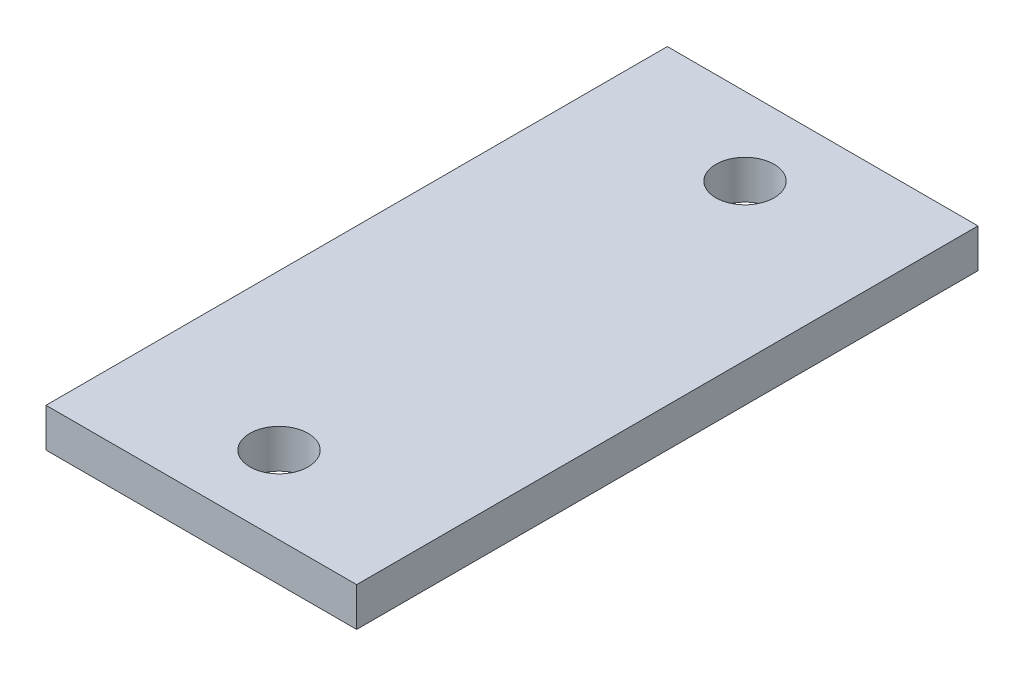
ISO-10303-21;
HEADER;
FILE_DESCRIPTION(('STEP AP214'),'2;1');
FILE_NAME('part.step','',(''),(''),'','','');
FILE_SCHEMA(('AUTOMOTIVE_DESIGN { 1 0 10303 214 1 1 1 1 }'));
ENDSEC;
DATA;
#1=APPLICATION_CONTEXT('core data for automotive mechanical design processes');
#2=APPLICATION_PROTOCOL_DEFINITION('international standard','automotive_design',2000,#1);
#3=PRODUCT_CONTEXT('',#1,'mechanical');
#4=PRODUCT('Part','Part','',(#3));
#5=PRODUCT_RELATED_PRODUCT_CATEGORY('part','',(#4));
#6=PRODUCT_DEFINITION_FORMATION('','',#4);
#7=PRODUCT_DEFINITION_CONTEXT('part definition',#1,'design');
#8=PRODUCT_DEFINITION('design','',#6,#7);
#9=PRODUCT_DEFINITION_SHAPE('','',#8);
#10=(LENGTH_UNIT() NAMED_UNIT(*) SI_UNIT(.MILLI.,.METRE.));
#11=(NAMED_UNIT(*) PLANE_ANGLE_UNIT() SI_UNIT($,.RADIAN.));
#12=(NAMED_UNIT(*) SI_UNIT($,.STERADIAN.) SOLID_ANGLE_UNIT());
#13=UNCERTAINTY_MEASURE_WITH_UNIT(LENGTH_MEASURE(1.E-05),#10,'distance_accuracy_value','');
#14=(GEOMETRIC_REPRESENTATION_CONTEXT(3) GLOBAL_UNCERTAINTY_ASSIGNED_CONTEXT((#13)) GLOBAL_UNIT_ASSIGNED_CONTEXT((#10,
#11,#12)) REPRESENTATION_CONTEXT('',''));
#15=CARTESIAN_POINT('',(0.,0.,0.));
#16=DIRECTION('',(0.,0.,1.));
#17=DIRECTION('',(1.,0.,0.));
#18=AXIS2_PLACEMENT_3D('',#15,#16,#17);
#19=CARTESIAN_POINT('',(0.,6.35,0.));
#20=DIRECTION('',(0.,-1.,0.));
#21=DIRECTION('',(0.,0.,-1.));
#22=AXIS2_PLACEMENT_3D('',#19,#20,#21);
#23=PLANE('',#22);
#24=DIRECTION('',(0.,0.,1.));
#25=VECTOR('',#24,1.);
#26=CARTESIAN_POINT('',(0.,6.35,0.));
#27=LINE('',#26,#25);
#28=CARTESIAN_POINT('',(0.,6.35,-101.6));
#29=VERTEX_POINT('',#28);
#30=CARTESIAN_POINT('',(0.,6.35,0.));
#31=VERTEX_POINT('',#30);
#32=EDGE_CURVE('E92',#29,#31,#27,.T.);
#33=ORIENTED_EDGE('',*,*,#32,.T.);
#34=DIRECTION('',(1.,0.,0.));
#35=VECTOR('',#34,1.);
#36=CARTESIAN_POINT('',(0.,6.35,0.));
#37=LINE('',#36,#35);
#38=CARTESIAN_POINT('',(50.8,6.35,0.));
#39=VERTEX_POINT('',#38);
#40=EDGE_CURVE('E87',#31,#39,#37,.T.);
#41=ORIENTED_EDGE('',*,*,#40,.T.);
#42=DIRECTION('',(0.,0.,-1.));
#43=VECTOR('',#42,1.);
#44=CARTESIAN_POINT('',(50.8,6.35,0.));
#45=LINE('',#44,#43);
#46=CARTESIAN_POINT('',(50.8,6.35,-101.6));
#47=VERTEX_POINT('',#46);
#48=EDGE_CURVE('E90',#39,#47,#45,.T.);
#49=ORIENTED_EDGE('',*,*,#48,.T.);
#50=DIRECTION('',(-1.,0.,0.));
#51=VECTOR('',#50,1.);
#52=CARTESIAN_POINT('',(0.,6.35,-101.6));
#53=LINE('',#52,#51);
#54=EDGE_CURVE('E57',#47,#29,#53,.T.);
#55=ORIENTED_EDGE('',*,*,#54,.T.);
#56=EDGE_LOOP('',(#33,#41,#49,#55));
#57=FACE_BOUND('',#56,.T.);
#58=CARTESIAN_POINT('',(25.4,6.35,-12.7));
#59=DIRECTION('',(0.,1.,0.));
#60=DIRECTION('',(0.,0.,1.));
#61=AXIS2_PLACEMENT_3D('',#58,#59,#60);
#62=CIRCLE('',#61,4.7625);
#63=CARTESIAN_POINT('',(25.4,6.35,-7.9375));
#64=VERTEX_POINT('',#63);
#65=EDGE_CURVE('E112',#64,#64,#62,.T.);
#66=ORIENTED_EDGE('',*,*,#65,.F.);
#67=EDGE_LOOP('',(#66));
#68=FACE_BOUND('',#67,.T.);
#69=CARTESIAN_POINT('',(25.4,6.35,-88.9));
#70=DIRECTION('',(0.,1.,0.));
#71=DIRECTION('',(0.,0.,1.));
#72=AXIS2_PLACEMENT_3D('',#69,#70,#71);
#73=CIRCLE('',#72,4.7625);
#74=CARTESIAN_POINT('',(25.4,6.35,-84.1375));
#75=VERTEX_POINT('',#74);
#76=EDGE_CURVE('E134',#75,#75,#73,.T.);
#77=ORIENTED_EDGE('',*,*,#76,.F.);
#78=EDGE_LOOP('',(#77));
#79=FACE_BOUND('',#78,.T.);
#80=ADVANCED_FACE('F39',(#57,#68,#79),#23,.F.);
#81=CARTESIAN_POINT('',(0.,0.,0.));
#82=DIRECTION('',(0.,-1.,0.));
#83=DIRECTION('',(0.,0.,-1.));
#84=AXIS2_PLACEMENT_3D('',#81,#82,#83);
#85=PLANE('',#84);
#86=CARTESIAN_POINT('',(25.4,0.,-12.7));
#87=DIRECTION('',(0.,1.,0.));
#88=DIRECTION('',(0.,0.,1.));
#89=AXIS2_PLACEMENT_3D('',#86,#87,#88);
#90=CIRCLE('',#89,4.7625);
#91=CARTESIAN_POINT('',(25.4,0.,-7.9375));
#92=VERTEX_POINT('',#91);
#93=EDGE_CURVE('E130',#92,#92,#90,.T.);
#94=ORIENTED_EDGE('',*,*,#93,.T.);
#95=EDGE_LOOP('',(#94));
#96=FACE_BOUND('',#95,.T.);
#97=DIRECTION('',(0.,0.,1.));
#98=VECTOR('',#97,1.);
#99=CARTESIAN_POINT('',(0.,0.,0.));
#100=LINE('',#99,#98);
#101=CARTESIAN_POINT('',(0.,0.,-101.6));
#102=VERTEX_POINT('',#101);
#103=CARTESIAN_POINT('',(0.,0.,0.));
#104=VERTEX_POINT('',#103);
#105=EDGE_CURVE('E108',#102,#104,#100,.T.);
#106=ORIENTED_EDGE('',*,*,#105,.F.);
#107=DIRECTION('',(-1.,0.,0.));
#108=VECTOR('',#107,1.);
#109=CARTESIAN_POINT('',(0.,0.,-101.6));
#110=LINE('',#109,#108);
#111=CARTESIAN_POINT('',(50.8,0.,-101.6));
#112=VERTEX_POINT('',#111);
#113=EDGE_CURVE('E80',#112,#102,#110,.T.);
#114=ORIENTED_EDGE('',*,*,#113,.F.);
#115=DIRECTION('',(0.,0.,-1.));
#116=VECTOR('',#115,1.);
#117=CARTESIAN_POINT('',(50.8,0.,0.));
#118=LINE('',#117,#116);
#119=CARTESIAN_POINT('',(50.8,0.,0.));
#120=VERTEX_POINT('',#119);
#121=EDGE_CURVE('E74',#120,#112,#118,.T.);
#122=ORIENTED_EDGE('',*,*,#121,.F.);
#123=DIRECTION('',(1.,0.,0.));
#124=VECTOR('',#123,1.);
#125=CARTESIAN_POINT('',(0.,0.,0.));
#126=LINE('',#125,#124);
#127=EDGE_CURVE('E97',#104,#120,#126,.T.);
#128=ORIENTED_EDGE('',*,*,#127,.F.);
#129=EDGE_LOOP('',(#106,#114,#122,#128));
#130=FACE_BOUND('',#129,.T.);
#131=CARTESIAN_POINT('',(25.4,0.,-88.9));
#132=DIRECTION('',(0.,1.,0.));
#133=DIRECTION('',(0.,0.,1.));
#134=AXIS2_PLACEMENT_3D('',#131,#132,#133);
#135=CIRCLE('',#134,4.7625);
#136=CARTESIAN_POINT('',(25.4,0.,-84.1375));
#137=VERTEX_POINT('',#136);
#138=EDGE_CURVE('E138',#137,#137,#135,.T.);
#139=ORIENTED_EDGE('',*,*,#138,.T.);
#140=EDGE_LOOP('',(#139));
#141=FACE_BOUND('',#140,.T.);
#142=ADVANCED_FACE('F125',(#96,#130,#141),#85,.T.);
#143=CARTESIAN_POINT('',(0.,6.35,0.));
#144=DIRECTION('',(1.,0.,0.));
#145=DIRECTION('',(0.,0.,-1.));
#146=AXIS2_PLACEMENT_3D('',#143,#144,#145);
#147=PLANE('',#146);
#148=ORIENTED_EDGE('',*,*,#105,.T.);
#149=DIRECTION('',(0.,-1.,0.));
#150=VECTOR('',#149,1.);
#151=CARTESIAN_POINT('',(0.,6.35,0.));
#152=LINE('',#151,#150);
#153=EDGE_CURVE('E11',#31,#104,#152,.T.);
#154=ORIENTED_EDGE('',*,*,#153,.F.);
#155=ORIENTED_EDGE('',*,*,#32,.F.);
#156=DIRECTION('',(0.,-1.,0.));
#157=VECTOR('',#156,1.);
#158=CARTESIAN_POINT('',(0.,6.35,-101.6));
#159=LINE('',#158,#157);
#160=EDGE_CURVE('E104',#29,#102,#159,.T.);
#161=ORIENTED_EDGE('',*,*,#160,.T.);
#162=EDGE_LOOP('',(#148,#154,#155,#161));
#163=FACE_BOUND('',#162,.T.);
#164=ADVANCED_FACE('F41',(#163),#147,.F.);
#165=CARTESIAN_POINT('',(0.,6.35,0.));
#166=DIRECTION('',(0.,0.,-1.));
#167=DIRECTION('',(-1.,0.,0.));
#168=AXIS2_PLACEMENT_3D('',#165,#166,#167);
#169=PLANE('',#168);
#170=ORIENTED_EDGE('',*,*,#127,.T.);
#171=DIRECTION('',(0.,-1.,0.));
#172=VECTOR('',#171,1.);
#173=CARTESIAN_POINT('',(50.8,6.35,0.));
#174=LINE('',#173,#172);
#175=EDGE_CURVE('E49',#39,#120,#174,.T.);
#176=ORIENTED_EDGE('',*,*,#175,.F.);
#177=ORIENTED_EDGE('',*,*,#40,.F.);
#178=ORIENTED_EDGE('',*,*,#153,.T.);
#179=EDGE_LOOP('',(#170,#176,#177,#178));
#180=FACE_BOUND('',#179,.T.);
#181=ADVANCED_FACE('F96',(#180),#169,.F.);
#182=CARTESIAN_POINT('',(50.8,6.35,0.));
#183=DIRECTION('',(-1.,0.,0.));
#184=DIRECTION('',(0.,0.,1.));
#185=AXIS2_PLACEMENT_3D('',#182,#183,#184);
#186=PLANE('',#185);
#187=ORIENTED_EDGE('',*,*,#121,.T.);
#188=DIRECTION('',(0.,-1.,0.));
#189=VECTOR('',#188,1.);
#190=CARTESIAN_POINT('',(50.8,6.35,-101.6));
#191=LINE('',#190,#189);
#192=EDGE_CURVE('E99',#47,#112,#191,.T.);
#193=ORIENTED_EDGE('',*,*,#192,.F.);
#194=ORIENTED_EDGE('',*,*,#48,.F.);
#195=ORIENTED_EDGE('',*,*,#175,.T.);
#196=EDGE_LOOP('',(#187,#193,#194,#195));
#197=FACE_BOUND('',#196,.T.);
#198=ADVANCED_FACE('F100',(#197),#186,.F.);
#199=CARTESIAN_POINT('',(0.,6.35,-101.6));
#200=DIRECTION('',(0.,0.,1.));
#201=DIRECTION('',(1.,0.,0.));
#202=AXIS2_PLACEMENT_3D('',#199,#200,#201);
#203=PLANE('',#202);
#204=ORIENTED_EDGE('',*,*,#113,.T.);
#205=ORIENTED_EDGE('',*,*,#160,.F.);
#206=ORIENTED_EDGE('',*,*,#54,.F.);
#207=ORIENTED_EDGE('',*,*,#192,.T.);
#208=EDGE_LOOP('',(#204,#205,#206,#207));
#209=FACE_BOUND('',#208,.T.);
#210=ADVANCED_FACE('F122',(#209),#203,.F.);
#211=CARTESIAN_POINT('',(25.4,6.35,-12.7));
#212=DIRECTION('',(0.,-1.,0.));
#213=DIRECTION('',(0.,0.,-1.));
#214=AXIS2_PLACEMENT_3D('',#211,#212,#213);
#215=CYLINDRICAL_SURFACE('',#214,4.7625);
#216=ORIENTED_EDGE('',*,*,#65,.T.);
#217=EDGE_LOOP('',(#216));
#218=FACE_BOUND('',#217,.T.);
#219=ORIENTED_EDGE('',*,*,#93,.F.);
#220=EDGE_LOOP('',(#219));
#221=FACE_BOUND('',#220,.T.);
#222=ADVANCED_FACE('F157',(#218,#221),#215,.F.);
#223=CARTESIAN_POINT('',(25.4,6.35,-88.9));
#224=DIRECTION('',(0.,-1.,0.));
#225=DIRECTION('',(0.,0.,-1.));
#226=AXIS2_PLACEMENT_3D('',#223,#224,#225);
#227=CYLINDRICAL_SURFACE('',#226,4.7625);
#228=ORIENTED_EDGE('',*,*,#76,.T.);
#229=EDGE_LOOP('',(#228));
#230=FACE_BOUND('',#229,.T.);
#231=ORIENTED_EDGE('',*,*,#138,.F.);
#232=EDGE_LOOP('',(#231));
#233=FACE_BOUND('',#232,.T.);
#234=ADVANCED_FACE('F146',(#230,#233),#227,.F.);
#235=CLOSED_SHELL('',(#80,#142,#164,#181,#198,#210,#222,#234));
#236=MANIFOLD_SOLID_BREP('B2',#235);
#237=ADVANCED_BREP_SHAPE_REPRESENTATION('',(#18,#236),#14);
#238=SHAPE_DEFINITION_REPRESENTATION(#9,#237);
ENDSEC;
END-ISO-10303-21;
